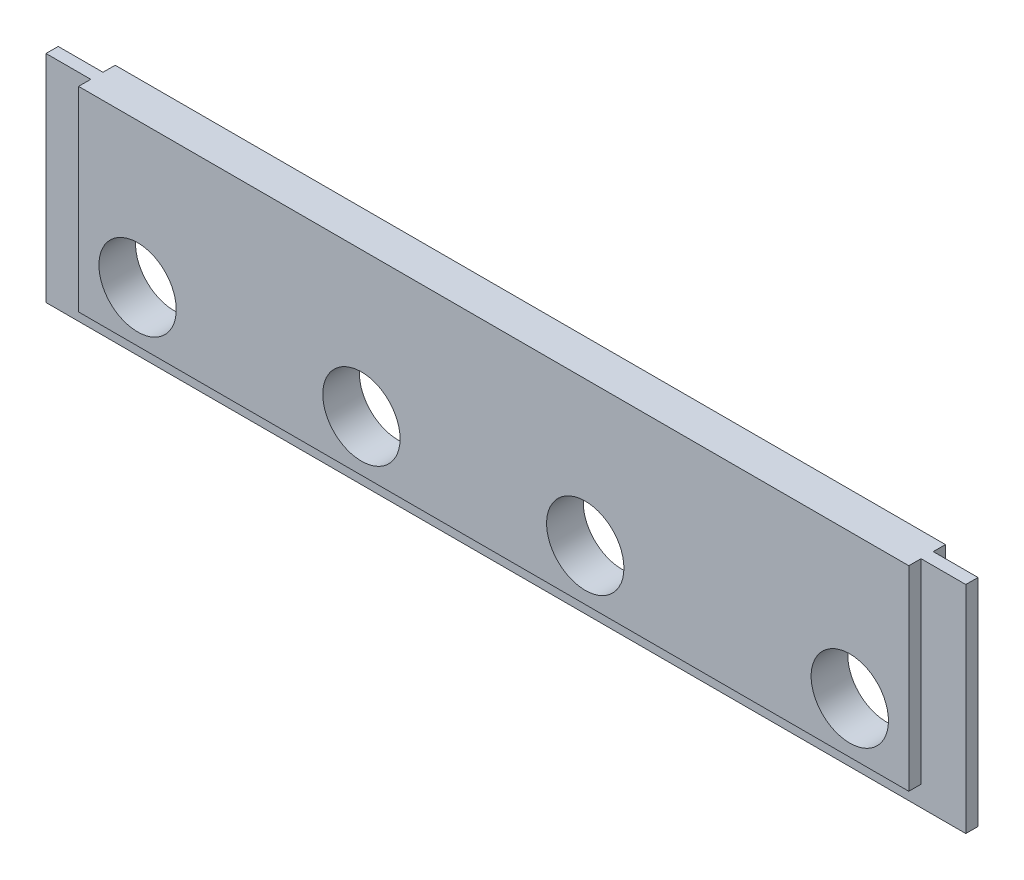
ISO-10303-21;
HEADER;
FILE_DESCRIPTION(('STEP AP214'),'2;1');
FILE_NAME('part.step','',(''),(''),'','','');
FILE_SCHEMA(('AUTOMOTIVE_DESIGN { 1 0 10303 214 1 1 1 1 }'));
ENDSEC;
DATA;
#1=APPLICATION_CONTEXT('core data for automotive mechanical design processes');
#2=APPLICATION_PROTOCOL_DEFINITION('international standard','automotive_design',2000,#1);
#3=PRODUCT_CONTEXT('',#1,'mechanical');
#4=PRODUCT('Part','Part','',(#3));
#5=PRODUCT_RELATED_PRODUCT_CATEGORY('part','',(#4));
#6=PRODUCT_DEFINITION_FORMATION('','',#4);
#7=PRODUCT_DEFINITION_CONTEXT('part definition',#1,'design');
#8=PRODUCT_DEFINITION('design','',#6,#7);
#9=PRODUCT_DEFINITION_SHAPE('','',#8);
#10=(LENGTH_UNIT() NAMED_UNIT(*) SI_UNIT(.MILLI.,.METRE.));
#11=(NAMED_UNIT(*) PLANE_ANGLE_UNIT() SI_UNIT($,.RADIAN.));
#12=(NAMED_UNIT(*) SI_UNIT($,.STERADIAN.) SOLID_ANGLE_UNIT());
#13=UNCERTAINTY_MEASURE_WITH_UNIT(LENGTH_MEASURE(1.E-05),#10,'distance_accuracy_value','');
#14=(GEOMETRIC_REPRESENTATION_CONTEXT(3) GLOBAL_UNCERTAINTY_ASSIGNED_CONTEXT((#13)) GLOBAL_UNIT_ASSIGNED_CONTEXT((#10,
#11,#12)) REPRESENTATION_CONTEXT('',''));
#15=CARTESIAN_POINT('',(0.,0.,0.));
#16=DIRECTION('',(0.,0.,1.));
#17=DIRECTION('',(1.,0.,0.));
#18=AXIS2_PLACEMENT_3D('',#15,#16,#17);
#19=CARTESIAN_POINT('',(-113.,-26.0197797000379,9.));
#20=DIRECTION('',(0.,1.,0.));
#21=DIRECTION('',(-1.,0.,0.));
#22=AXIS2_PLACEMENT_3D('',#19,#20,#21);
#23=PLANE('',#22);
#24=DIRECTION('',(1.,0.,0.));
#25=VECTOR('',#24,1.);
#26=CARTESIAN_POINT('',(0.,-26.0197797000379,3.));
#27=LINE('',#26,#25);
#28=CARTESIAN_POINT('',(-113.,-26.0197797000379,3.));
#29=VERTEX_POINT('',#28);
#30=CARTESIAN_POINT('',(113.,-26.0197797000379,3.00000000000002));
#31=VERTEX_POINT('',#30);
#32=EDGE_CURVE('E265',#29,#31,#27,.T.);
#33=ORIENTED_EDGE('',*,*,#32,.T.);
#34=DIRECTION('',(0.,0.,-1.));
#35=VECTOR('',#34,1.);
#36=CARTESIAN_POINT('',(113.,-26.0197797000379,9.));
#37=LINE('',#36,#35);
#38=CARTESIAN_POINT('',(113.,-26.0197797000379,6.00000000000002));
#39=VERTEX_POINT('',#38);
#40=EDGE_CURVE('E211',#39,#31,#37,.T.);
#41=ORIENTED_EDGE('',*,*,#40,.F.);
#42=DIRECTION('',(-1.,0.,0.));
#43=VECTOR('',#42,1.);
#44=CARTESIAN_POINT('',(0.,-26.0197797000379,6.));
#45=LINE('',#44,#43);
#46=CARTESIAN_POINT('',(-113.,-26.0197797000379,6.));
#47=VERTEX_POINT('',#46);
#48=EDGE_CURVE('E245',#39,#47,#45,.T.);
#49=ORIENTED_EDGE('',*,*,#48,.T.);
#50=DIRECTION('',(0.,0.,-1.));
#51=VECTOR('',#50,1.);
#52=CARTESIAN_POINT('',(-113.,-26.0197797000379,9.));
#53=LINE('',#52,#51);
#54=EDGE_CURVE('E218',#47,#29,#53,.T.);
#55=ORIENTED_EDGE('',*,*,#54,.T.);
#56=EDGE_LOOP('',(#33,#41,#49,#55));
#57=FACE_BOUND('',#56,.T.);
#58=ADVANCED_FACE('F40',(#57),#23,.F.);
#59=CARTESIAN_POINT('',(0.,0.,9.));
#60=DIRECTION('',(0.,0.,-1.));
#61=DIRECTION('',(-1.,0.,0.));
#62=AXIS2_PLACEMENT_3D('',#59,#60,#61);
#63=PLANE('',#62);
#64=CARTESIAN_POINT('',(-87.5,-8.51977970003793,9.));
#65=DIRECTION('',(0.,0.,1.));
#66=DIRECTION('',(1.,0.,0.));
#67=AXIS2_PLACEMENT_3D('',#64,#65,#66);
#68=CIRCLE('',#67,9.5);
#69=CARTESIAN_POINT('',(-78.,-8.51977970003793,9.));
#70=VERTEX_POINT('',#69);
#71=EDGE_CURVE('E181',#70,#70,#68,.T.);
#72=ORIENTED_EDGE('',*,*,#71,.F.);
#73=EDGE_LOOP('',(#72));
#74=FACE_BOUND('',#73,.T.);
#75=CARTESIAN_POINT('',(-32.5,-8.51977970003793,9.));
#76=DIRECTION('',(0.,0.,1.));
#77=DIRECTION('',(1.,0.,0.));
#78=AXIS2_PLACEMENT_3D('',#75,#76,#77);
#79=CIRCLE('',#78,9.5);
#80=CARTESIAN_POINT('',(-23.,-8.51977970003793,9.));
#81=VERTEX_POINT('',#80);
#82=EDGE_CURVE('E189',#81,#81,#79,.T.);
#83=ORIENTED_EDGE('',*,*,#82,.F.);
#84=EDGE_LOOP('',(#83));
#85=FACE_BOUND('',#84,.T.);
#86=CARTESIAN_POINT('',(22.5,-8.51977970003793,9.));
#87=DIRECTION('',(0.,0.,1.));
#88=DIRECTION('',(1.,0.,0.));
#89=AXIS2_PLACEMENT_3D('',#86,#87,#88);
#90=CIRCLE('',#89,9.5);
#91=CARTESIAN_POINT('',(32.,-8.51977970003793,9.));
#92=VERTEX_POINT('',#91);
#93=EDGE_CURVE('E197',#92,#92,#90,.T.);
#94=ORIENTED_EDGE('',*,*,#93,.F.);
#95=EDGE_LOOP('',(#94));
#96=FACE_BOUND('',#95,.T.);
#97=CARTESIAN_POINT('',(87.5,-8.51977970003793,9.));
#98=DIRECTION('',(0.,0.,1.));
#99=DIRECTION('',(1.,0.,0.));
#100=AXIS2_PLACEMENT_3D('',#97,#98,#99);
#101=CIRCLE('',#100,9.50000000000001);
#102=CARTESIAN_POINT('',(97.,-8.51977970003793,9.));
#103=VERTEX_POINT('',#102);
#104=EDGE_CURVE('E168',#103,#103,#101,.T.);
#105=ORIENTED_EDGE('',*,*,#104,.F.);
#106=EDGE_LOOP('',(#105));
#107=FACE_BOUND('',#106,.T.);
#108=DIRECTION('',(-1.,0.,0.));
#109=VECTOR('',#108,1.);
#110=CARTESIAN_POINT('',(113.,-21.0197797000379,9.));
#111=LINE('',#110,#109);
#112=CARTESIAN_POINT('',(102.,-21.0197797000379,9.));
#113=VERTEX_POINT('',#112);
#114=CARTESIAN_POINT('',(-102.,-21.0197797000379,9.));
#115=VERTEX_POINT('',#114);
#116=EDGE_CURVE('E131',#113,#115,#111,.T.);
#117=ORIENTED_EDGE('',*,*,#116,.F.);
#118=DIRECTION('',(0.,-1.,0.));
#119=VECTOR('',#118,1.);
#120=CARTESIAN_POINT('',(102.,26.9802202999621,9.));
#121=LINE('',#120,#119);
#122=CARTESIAN_POINT('',(102.,26.9802202999621,9.));
#123=VERTEX_POINT('',#122);
#124=EDGE_CURVE('E140',#123,#113,#121,.T.);
#125=ORIENTED_EDGE('',*,*,#124,.F.);
#126=DIRECTION('',(-1.,0.,0.));
#127=VECTOR('',#126,1.);
#128=CARTESIAN_POINT('',(-113.,26.9802202999621,9.));
#129=LINE('',#128,#127);
#130=CARTESIAN_POINT('',(-102.,26.9802202999621,9.));
#131=VERTEX_POINT('',#130);
#132=EDGE_CURVE('E208',#123,#131,#129,.T.);
#133=ORIENTED_EDGE('',*,*,#132,.T.);
#134=DIRECTION('',(0.,-1.,0.));
#135=VECTOR('',#134,1.);
#136=CARTESIAN_POINT('',(-102.,26.9802202999621,9.));
#137=LINE('',#136,#135);
#138=EDGE_CURVE('E142',#131,#115,#137,.T.);
#139=ORIENTED_EDGE('',*,*,#138,.T.);
#140=EDGE_LOOP('',(#117,#125,#133,#139));
#141=FACE_BOUND('',#140,.T.);
#142=ADVANCED_FACE('F138',(#74,#85,#96,#107,#141),#63,.F.);
#143=CARTESIAN_POINT('',(0.,0.,0.));
#144=DIRECTION('',(0.,0.,-1.));
#145=DIRECTION('',(-1.,0.,0.));
#146=AXIS2_PLACEMENT_3D('',#143,#144,#145);
#147=PLANE('',#146);
#148=CARTESIAN_POINT('',(-87.5,-8.51977970003793,0.));
#149=DIRECTION('',(0.,0.,1.));
#150=DIRECTION('',(1.,0.,0.));
#151=AXIS2_PLACEMENT_3D('',#148,#149,#150);
#152=CIRCLE('',#151,9.5);
#153=CARTESIAN_POINT('',(-78.,-8.51977970003793,0.));
#154=VERTEX_POINT('',#153);
#155=EDGE_CURVE('E176',#154,#154,#152,.T.);
#156=ORIENTED_EDGE('',*,*,#155,.T.);
#157=EDGE_LOOP('',(#156));
#158=FACE_BOUND('',#157,.T.);
#159=CARTESIAN_POINT('',(-32.5,-8.51977970003793,0.));
#160=DIRECTION('',(0.,0.,1.));
#161=DIRECTION('',(1.,0.,0.));
#162=AXIS2_PLACEMENT_3D('',#159,#160,#161);
#163=CIRCLE('',#162,9.5);
#164=CARTESIAN_POINT('',(-23.,-8.51977970003793,0.));
#165=VERTEX_POINT('',#164);
#166=EDGE_CURVE('E185',#165,#165,#163,.T.);
#167=ORIENTED_EDGE('',*,*,#166,.T.);
#168=EDGE_LOOP('',(#167));
#169=FACE_BOUND('',#168,.T.);
#170=CARTESIAN_POINT('',(22.5,-8.51977970003793,0.));
#171=DIRECTION('',(0.,0.,1.));
#172=DIRECTION('',(1.,0.,0.));
#173=AXIS2_PLACEMENT_3D('',#170,#171,#172);
#174=CIRCLE('',#173,9.5);
#175=CARTESIAN_POINT('',(32.,-8.51977970003793,0.));
#176=VERTEX_POINT('',#175);
#177=EDGE_CURVE('E193',#176,#176,#174,.T.);
#178=ORIENTED_EDGE('',*,*,#177,.T.);
#179=EDGE_LOOP('',(#178));
#180=FACE_BOUND('',#179,.T.);
#181=CARTESIAN_POINT('',(87.5,-8.51977970003793,0.));
#182=DIRECTION('',(0.,0.,1.));
#183=DIRECTION('',(1.,0.,0.));
#184=AXIS2_PLACEMENT_3D('',#181,#182,#183);
#185=CIRCLE('',#184,9.50000000000001);
#186=CARTESIAN_POINT('',(97.,-8.51977970003793,0.));
#187=VERTEX_POINT('',#186);
#188=EDGE_CURVE('E201',#187,#187,#185,.T.);
#189=ORIENTED_EDGE('',*,*,#188,.T.);
#190=EDGE_LOOP('',(#189));
#191=FACE_BOUND('',#190,.T.);
#192=DIRECTION('',(0.,-1.,0.));
#193=VECTOR('',#192,1.);
#194=CARTESIAN_POINT('',(102.,26.9802202999621,0.));
#195=LINE('',#194,#193);
#196=CARTESIAN_POINT('',(102.,26.9802202999621,0.));
#197=VERTEX_POINT('',#196);
#198=CARTESIAN_POINT('',(102.,-21.0197797000379,0.));
#199=VERTEX_POINT('',#198);
#200=EDGE_CURVE('E246',#197,#199,#195,.T.);
#201=ORIENTED_EDGE('',*,*,#200,.T.);
#202=DIRECTION('',(-1.,0.,0.));
#203=VECTOR('',#202,1.);
#204=CARTESIAN_POINT('',(113.,-21.0197797000379,0.));
#205=LINE('',#204,#203);
#206=CARTESIAN_POINT('',(-102.,-21.0197797000379,0.));
#207=VERTEX_POINT('',#206);
#208=EDGE_CURVE('E291',#199,#207,#205,.T.);
#209=ORIENTED_EDGE('',*,*,#208,.T.);
#210=DIRECTION('',(0.,-1.,0.));
#211=VECTOR('',#210,1.);
#212=CARTESIAN_POINT('',(-102.,26.9802202999621,0.));
#213=LINE('',#212,#211);
#214=CARTESIAN_POINT('',(-102.,26.9802202999621,0.));
#215=VERTEX_POINT('',#214);
#216=EDGE_CURVE('E274',#215,#207,#213,.T.);
#217=ORIENTED_EDGE('',*,*,#216,.F.);
#218=DIRECTION('',(-1.,0.,0.));
#219=VECTOR('',#218,1.);
#220=CARTESIAN_POINT('',(-113.,26.9802202999621,0.));
#221=LINE('',#220,#219);
#222=EDGE_CURVE('E180',#197,#215,#221,.T.);
#223=ORIENTED_EDGE('',*,*,#222,.F.);
#224=EDGE_LOOP('',(#201,#209,#217,#223));
#225=FACE_BOUND('',#224,.T.);
#226=ADVANCED_FACE('F312',(#158,#169,#180,#191,#225),#147,.T.);
#227=CARTESIAN_POINT('',(102.,26.9802202999621,1.57281595155231E-13));
#228=DIRECTION('',(-1.,0.,0.));
#229=DIRECTION('',(0.,0.,1.));
#230=AXIS2_PLACEMENT_3D('',#227,#228,#229);
#231=PLANE('',#230);
#232=DIRECTION('',(0.,0.,1.));
#233=VECTOR('',#232,1.);
#234=CARTESIAN_POINT('',(102.,-21.0197797000379,1.38777878078145E-13));
#235=LINE('',#234,#233);
#236=CARTESIAN_POINT('',(102.,-21.0197797000379,3.));
#237=VERTEX_POINT('',#236);
#238=EDGE_CURVE('E302',#199,#237,#235,.T.);
#239=ORIENTED_EDGE('',*,*,#238,.F.);
#240=ORIENTED_EDGE('',*,*,#200,.F.);
#241=DIRECTION('',(0.,0.,-1.));
#242=VECTOR('',#241,1.);
#243=CARTESIAN_POINT('',(102.,26.9802202999621,1.57281595155231E-13));
#244=LINE('',#243,#242);
#245=CARTESIAN_POINT('',(102.,26.9802202999621,3.00000000000002));
#246=VERTEX_POINT('',#245);
#247=EDGE_CURVE('E255',#246,#197,#244,.T.);
#248=ORIENTED_EDGE('',*,*,#247,.F.);
#249=DIRECTION('',(0.,-1.,0.));
#250=VECTOR('',#249,1.);
#251=CARTESIAN_POINT('',(102.,26.9802202999621,3.00000000000002));
#252=LINE('',#251,#250);
#253=EDGE_CURVE('E252',#246,#237,#252,.T.);
#254=ORIENTED_EDGE('',*,*,#253,.T.);
#255=EDGE_LOOP('',(#239,#240,#248,#254));
#256=FACE_BOUND('',#255,.T.);
#257=ADVANCED_FACE('F374',(#256),#231,.F.);
#258=CARTESIAN_POINT('',(-102.,26.9802202999621,1.57281595155231E-13));
#259=DIRECTION('',(-1.,0.,0.));
#260=DIRECTION('',(0.,0.,1.));
#261=AXIS2_PLACEMENT_3D('',#258,#259,#260);
#262=PLANE('',#261);
#263=ORIENTED_EDGE('',*,*,#216,.T.);
#264=DIRECTION('',(0.,0.,1.));
#265=VECTOR('',#264,1.);
#266=CARTESIAN_POINT('',(-102.,-21.0197797000379,1.38777878078145E-13));
#267=LINE('',#266,#265);
#268=CARTESIAN_POINT('',(-102.,-21.0197797000379,3.));
#269=VERTEX_POINT('',#268);
#270=EDGE_CURVE('E12',#207,#269,#267,.T.);
#271=ORIENTED_EDGE('',*,*,#270,.T.);
#272=DIRECTION('',(0.,-1.,0.));
#273=VECTOR('',#272,1.);
#274=CARTESIAN_POINT('',(-102.,26.9802202999621,3.));
#275=LINE('',#274,#273);
#276=CARTESIAN_POINT('',(-102.,26.9802202999621,3.));
#277=VERTEX_POINT('',#276);
#278=EDGE_CURVE('E162',#277,#269,#275,.T.);
#279=ORIENTED_EDGE('',*,*,#278,.F.);
#280=DIRECTION('',(0.,0.,-1.));
#281=VECTOR('',#280,1.);
#282=CARTESIAN_POINT('',(-102.,26.9802202999621,1.57281595155231E-13));
#283=LINE('',#282,#281);
#284=EDGE_CURVE('E264',#277,#215,#283,.T.);
#285=ORIENTED_EDGE('',*,*,#284,.T.);
#286=EDGE_LOOP('',(#263,#271,#279,#285));
#287=FACE_BOUND('',#286,.T.);
#288=ADVANCED_FACE('F314',(#287),#262,.T.);
#289=CARTESIAN_POINT('',(-102.,26.9802202999621,1.57281595155231E-13));
#290=DIRECTION('',(-1.,0.,0.));
#291=DIRECTION('',(0.,0.,1.));
#292=AXIS2_PLACEMENT_3D('',#289,#290,#291);
#293=PLANE('',#292);
#294=DIRECTION('',(0.,-1.,0.));
#295=VECTOR('',#294,1.);
#296=CARTESIAN_POINT('',(-102.,26.9802202999621,6.));
#297=LINE('',#296,#295);
#298=CARTESIAN_POINT('',(-102.,26.9802202999621,6.));
#299=VERTEX_POINT('',#298);
#300=CARTESIAN_POINT('',(-102.,-21.0197797000379,6.));
#301=VERTEX_POINT('',#300);
#302=EDGE_CURVE('E169',#299,#301,#297,.T.);
#303=ORIENTED_EDGE('',*,*,#302,.T.);
#304=DIRECTION('',(0.,0.,1.));
#305=VECTOR('',#304,1.);
#306=CARTESIAN_POINT('',(-102.,-21.0197797000379,1.38777878078145E-13));
#307=LINE('',#306,#305);
#308=EDGE_CURVE('E299',#301,#115,#307,.T.);
#309=ORIENTED_EDGE('',*,*,#308,.T.);
#310=ORIENTED_EDGE('',*,*,#138,.F.);
#311=DIRECTION('',(0.,0.,-1.));
#312=VECTOR('',#311,1.);
#313=CARTESIAN_POINT('',(-102.,26.9802202999621,1.57281595155231E-13));
#314=LINE('',#313,#312);
#315=EDGE_CURVE('E161',#131,#299,#314,.T.);
#316=ORIENTED_EDGE('',*,*,#315,.T.);
#317=EDGE_LOOP('',(#303,#309,#310,#316));
#318=FACE_BOUND('',#317,.T.);
#319=ADVANCED_FACE('F286',(#318),#293,.T.);
#320=CARTESIAN_POINT('',(102.,26.9802202999621,1.57281595155231E-13));
#321=DIRECTION('',(-1.,0.,0.));
#322=DIRECTION('',(0.,0.,1.));
#323=AXIS2_PLACEMENT_3D('',#320,#321,#322);
#324=PLANE('',#323);
#325=DIRECTION('',(0.,0.,1.));
#326=VECTOR('',#325,1.);
#327=CARTESIAN_POINT('',(102.,-21.0197797000379,1.38777878078145E-13));
#328=LINE('',#327,#326);
#329=CARTESIAN_POINT('',(102.,-21.0197797000379,6.00000000000002));
#330=VERTEX_POINT('',#329);
#331=EDGE_CURVE('E49',#330,#113,#328,.T.);
#332=ORIENTED_EDGE('',*,*,#331,.F.);
#333=DIRECTION('',(0.,-1.,0.));
#334=VECTOR('',#333,1.);
#335=CARTESIAN_POINT('',(102.,26.9802202999621,6.00000000000002));
#336=LINE('',#335,#334);
#337=CARTESIAN_POINT('',(102.,26.9802202999621,6.00000000000002));
#338=VERTEX_POINT('',#337);
#339=EDGE_CURVE('E147',#338,#330,#336,.T.);
#340=ORIENTED_EDGE('',*,*,#339,.F.);
#341=DIRECTION('',(0.,0.,-1.));
#342=VECTOR('',#341,1.);
#343=CARTESIAN_POINT('',(102.,26.9802202999621,1.57281595155231E-13));
#344=LINE('',#343,#342);
#345=EDGE_CURVE('E64',#123,#338,#344,.T.);
#346=ORIENTED_EDGE('',*,*,#345,.F.);
#347=ORIENTED_EDGE('',*,*,#124,.T.);
#348=EDGE_LOOP('',(#332,#340,#346,#347));
#349=FACE_BOUND('',#348,.T.);
#350=ADVANCED_FACE('F145',(#349),#324,.F.);
#351=CARTESIAN_POINT('',(113.,-26.0197797000379,9.));
#352=DIRECTION('',(-1.,0.,0.));
#353=DIRECTION('',(0.,0.,1.));
#354=AXIS2_PLACEMENT_3D('',#351,#352,#353);
#355=PLANE('',#354);
#356=DIRECTION('',(0.,-1.,0.));
#357=VECTOR('',#356,1.);
#358=CARTESIAN_POINT('',(113.,26.9802202999621,6.00000000000002));
#359=LINE('',#358,#357);
#360=CARTESIAN_POINT('',(113.,26.9802202999621,6.00000000000002));
#361=VERTEX_POINT('',#360);
#362=EDGE_CURVE('E152',#361,#39,#359,.T.);
#363=ORIENTED_EDGE('',*,*,#362,.T.);
#364=ORIENTED_EDGE('',*,*,#40,.T.);
#365=DIRECTION('',(0.,-1.,0.));
#366=VECTOR('',#365,1.);
#367=CARTESIAN_POINT('',(113.,26.9802202999621,3.00000000000002));
#368=LINE('',#367,#366);
#369=CARTESIAN_POINT('',(113.,26.9802202999621,3.00000000000002));
#370=VERTEX_POINT('',#369);
#371=EDGE_CURVE('E239',#370,#31,#368,.T.);
#372=ORIENTED_EDGE('',*,*,#371,.F.);
#373=DIRECTION('',(0.,0.,-1.));
#374=VECTOR('',#373,1.);
#375=CARTESIAN_POINT('',(113.,26.9802202999621,9.));
#376=LINE('',#375,#374);
#377=EDGE_CURVE('E135',#361,#370,#376,.T.);
#378=ORIENTED_EDGE('',*,*,#377,.F.);
#379=EDGE_LOOP('',(#363,#364,#372,#378));
#380=FACE_BOUND('',#379,.T.);
#381=ADVANCED_FACE('F42',(#380),#355,.F.);
#382=CARTESIAN_POINT('',(-113.,26.9802202999621,9.));
#383=DIRECTION('',(0.,-1.,0.));
#384=DIRECTION('',(1.,0.,0.));
#385=AXIS2_PLACEMENT_3D('',#382,#383,#384);
#386=PLANE('',#385);
#387=DIRECTION('',(1.,0.,0.));
#388=VECTOR('',#387,1.);
#389=CARTESIAN_POINT('',(0.,26.9802202999621,3.));
#390=LINE('',#389,#388);
#391=CARTESIAN_POINT('',(-113.,26.9802202999621,3.));
#392=VERTEX_POINT('',#391);
#393=EDGE_CURVE('E261',#392,#277,#390,.T.);
#394=ORIENTED_EDGE('',*,*,#393,.F.);
#395=DIRECTION('',(0.,0.,-1.));
#396=VECTOR('',#395,1.);
#397=CARTESIAN_POINT('',(-113.,26.9802202999621,9.));
#398=LINE('',#397,#396);
#399=CARTESIAN_POINT('',(-113.,26.9802202999621,6.));
#400=VERTEX_POINT('',#399);
#401=EDGE_CURVE('E222',#400,#392,#398,.T.);
#402=ORIENTED_EDGE('',*,*,#401,.F.);
#403=DIRECTION('',(1.,0.,0.));
#404=VECTOR('',#403,1.);
#405=CARTESIAN_POINT('',(0.,26.9802202999621,6.));
#406=LINE('',#405,#404);
#407=EDGE_CURVE('E157',#400,#299,#406,.T.);
#408=ORIENTED_EDGE('',*,*,#407,.T.);
#409=ORIENTED_EDGE('',*,*,#315,.F.);
#410=ORIENTED_EDGE('',*,*,#132,.F.);
#411=ORIENTED_EDGE('',*,*,#345,.T.);
#412=DIRECTION('',(-1.,0.,0.));
#413=VECTOR('',#412,1.);
#414=CARTESIAN_POINT('',(0.,26.9802202999621,6.));
#415=LINE('',#414,#413);
#416=EDGE_CURVE('E148',#361,#338,#415,.T.);
#417=ORIENTED_EDGE('',*,*,#416,.F.);
#418=ORIENTED_EDGE('',*,*,#377,.T.);
#419=DIRECTION('',(-1.,0.,0.));
#420=VECTOR('',#419,1.);
#421=CARTESIAN_POINT('',(0.,26.9802202999621,3.));
#422=LINE('',#421,#420);
#423=EDGE_CURVE('E235',#370,#246,#422,.T.);
#424=ORIENTED_EDGE('',*,*,#423,.T.);
#425=ORIENTED_EDGE('',*,*,#247,.T.);
#426=ORIENTED_EDGE('',*,*,#222,.T.);
#427=ORIENTED_EDGE('',*,*,#284,.F.);
#428=EDGE_LOOP('',(#394,#402,#408,#409,#410,#411,#417,#418,#424,#425,#426,#427));
#429=FACE_BOUND('',#428,.T.);
#430=ADVANCED_FACE('F233',(#429),#386,.F.);
#431=CARTESIAN_POINT('',(-113.,-26.0197797000379,9.));
#432=DIRECTION('',(1.,0.,0.));
#433=DIRECTION('',(0.,0.,-1.));
#434=AXIS2_PLACEMENT_3D('',#431,#432,#433);
#435=PLANE('',#434);
#436=DIRECTION('',(0.,-1.,0.));
#437=VECTOR('',#436,1.);
#438=CARTESIAN_POINT('',(-113.,26.9802202999621,3.));
#439=LINE('',#438,#437);
#440=EDGE_CURVE('E268',#392,#29,#439,.T.);
#441=ORIENTED_EDGE('',*,*,#440,.T.);
#442=ORIENTED_EDGE('',*,*,#54,.F.);
#443=DIRECTION('',(0.,-1.,0.));
#444=VECTOR('',#443,1.);
#445=CARTESIAN_POINT('',(-113.,26.9802202999621,6.));
#446=LINE('',#445,#444);
#447=EDGE_CURVE('E165',#400,#47,#446,.T.);
#448=ORIENTED_EDGE('',*,*,#447,.F.);
#449=ORIENTED_EDGE('',*,*,#401,.T.);
#450=EDGE_LOOP('',(#441,#442,#448,#449));
#451=FACE_BOUND('',#450,.T.);
#452=ADVANCED_FACE('F317',(#451),#435,.F.);
#453=CARTESIAN_POINT('',(87.5,-8.51977970003793,0.));
#454=DIRECTION('',(0.,0.,1.));
#455=DIRECTION('',(1.,0.,0.));
#456=AXIS2_PLACEMENT_3D('',#453,#454,#455);
#457=CYLINDRICAL_SURFACE('',#456,9.50000000000001);
#458=ORIENTED_EDGE('',*,*,#188,.F.);
#459=EDGE_LOOP('',(#458));
#460=FACE_BOUND('',#459,.T.);
#461=ORIENTED_EDGE('',*,*,#104,.T.);
#462=EDGE_LOOP('',(#461));
#463=FACE_BOUND('',#462,.T.);
#464=ADVANCED_FACE('F343',(#460,#463),#457,.F.);
#465=CARTESIAN_POINT('',(22.5,-8.51977970003793,0.));
#466=DIRECTION('',(0.,0.,1.));
#467=DIRECTION('',(1.,0.,0.));
#468=AXIS2_PLACEMENT_3D('',#465,#466,#467);
#469=CYLINDRICAL_SURFACE('',#468,9.5);
#470=ORIENTED_EDGE('',*,*,#177,.F.);
#471=EDGE_LOOP('',(#470));
#472=FACE_BOUND('',#471,.T.);
#473=ORIENTED_EDGE('',*,*,#93,.T.);
#474=EDGE_LOOP('',(#473));
#475=FACE_BOUND('',#474,.T.);
#476=ADVANCED_FACE('F359',(#472,#475),#469,.F.);
#477=CARTESIAN_POINT('',(-32.5,-8.51977970003793,0.));
#478=DIRECTION('',(0.,0.,1.));
#479=DIRECTION('',(1.,0.,0.));
#480=AXIS2_PLACEMENT_3D('',#477,#478,#479);
#481=CYLINDRICAL_SURFACE('',#480,9.5);
#482=ORIENTED_EDGE('',*,*,#166,.F.);
#483=EDGE_LOOP('',(#482));
#484=FACE_BOUND('',#483,.T.);
#485=ORIENTED_EDGE('',*,*,#82,.T.);
#486=EDGE_LOOP('',(#485));
#487=FACE_BOUND('',#486,.T.);
#488=ADVANCED_FACE('F329',(#484,#487),#481,.F.);
#489=CARTESIAN_POINT('',(-87.5,-8.51977970003793,0.));
#490=DIRECTION('',(0.,0.,1.));
#491=DIRECTION('',(1.,0.,0.));
#492=AXIS2_PLACEMENT_3D('',#489,#490,#491);
#493=CYLINDRICAL_SURFACE('',#492,9.5);
#494=ORIENTED_EDGE('',*,*,#155,.F.);
#495=EDGE_LOOP('',(#494));
#496=FACE_BOUND('',#495,.T.);
#497=ORIENTED_EDGE('',*,*,#71,.T.);
#498=EDGE_LOOP('',(#497));
#499=FACE_BOUND('',#498,.T.);
#500=ADVANCED_FACE('F322',(#496,#499),#493,.F.);
#501=CARTESIAN_POINT('',(0.,26.9802202999621,3.));
#502=DIRECTION('',(0.,0.,-1.));
#503=DIRECTION('',(-1.,0.,0.));
#504=AXIS2_PLACEMENT_3D('',#501,#502,#503);
#505=PLANE('',#504);
#506=ORIENTED_EDGE('',*,*,#32,.F.);
#507=ORIENTED_EDGE('',*,*,#440,.F.);
#508=ORIENTED_EDGE('',*,*,#393,.T.);
#509=ORIENTED_EDGE('',*,*,#278,.T.);
#510=DIRECTION('',(-1.,0.,0.));
#511=VECTOR('',#510,1.);
#512=CARTESIAN_POINT('',(113.,-21.0197797000379,3.));
#513=LINE('',#512,#511);
#514=EDGE_CURVE('E295',#237,#269,#513,.T.);
#515=ORIENTED_EDGE('',*,*,#514,.F.);
#516=ORIENTED_EDGE('',*,*,#253,.F.);
#517=ORIENTED_EDGE('',*,*,#423,.F.);
#518=ORIENTED_EDGE('',*,*,#371,.T.);
#519=EDGE_LOOP('',(#506,#507,#508,#509,#515,#516,#517,#518));
#520=FACE_BOUND('',#519,.T.);
#521=ADVANCED_FACE('F320',(#520),#505,.T.);
#522=CARTESIAN_POINT('',(0.,26.9802202999621,6.));
#523=DIRECTION('',(0.,0.,1.));
#524=DIRECTION('',(1.,0.,0.));
#525=AXIS2_PLACEMENT_3D('',#522,#523,#524);
#526=PLANE('',#525);
#527=ORIENTED_EDGE('',*,*,#48,.F.);
#528=ORIENTED_EDGE('',*,*,#362,.F.);
#529=ORIENTED_EDGE('',*,*,#416,.T.);
#530=ORIENTED_EDGE('',*,*,#339,.T.);
#531=DIRECTION('',(-1.,0.,0.));
#532=VECTOR('',#531,1.);
#533=CARTESIAN_POINT('',(113.,-21.0197797000379,6.));
#534=LINE('',#533,#532);
#535=EDGE_CURVE('E56',#330,#301,#534,.T.);
#536=ORIENTED_EDGE('',*,*,#535,.T.);
#537=ORIENTED_EDGE('',*,*,#302,.F.);
#538=ORIENTED_EDGE('',*,*,#407,.F.);
#539=ORIENTED_EDGE('',*,*,#447,.T.);
#540=EDGE_LOOP('',(#527,#528,#529,#530,#536,#537,#538,#539));
#541=FACE_BOUND('',#540,.T.);
#542=ADVANCED_FACE('F288',(#541),#526,.T.);
#543=CARTESIAN_POINT('',(113.,-21.0197797000379,0.));
#544=DIRECTION('',(0.,-1.,0.));
#545=DIRECTION('',(0.,0.,-1.));
#546=AXIS2_PLACEMENT_3D('',#543,#544,#545);
#547=PLANE('',#546);
#548=ORIENTED_EDGE('',*,*,#535,.F.);
#549=ORIENTED_EDGE('',*,*,#331,.T.);
#550=ORIENTED_EDGE('',*,*,#116,.T.);
#551=ORIENTED_EDGE('',*,*,#308,.F.);
#552=EDGE_LOOP('',(#548,#549,#550,#551));
#553=FACE_BOUND('',#552,.T.);
#554=ADVANCED_FACE('F130',(#553),#547,.T.);
#555=CARTESIAN_POINT('',(113.,-21.0197797000379,0.));
#556=DIRECTION('',(0.,-1.,0.));
#557=DIRECTION('',(0.,0.,-1.));
#558=AXIS2_PLACEMENT_3D('',#555,#556,#557);
#559=PLANE('',#558);
#560=ORIENTED_EDGE('',*,*,#238,.T.);
#561=ORIENTED_EDGE('',*,*,#514,.T.);
#562=ORIENTED_EDGE('',*,*,#270,.F.);
#563=ORIENTED_EDGE('',*,*,#208,.F.);
#564=EDGE_LOOP('',(#560,#561,#562,#563));
#565=FACE_BOUND('',#564,.T.);
#566=ADVANCED_FACE('F400',(#565),#559,.T.);
#567=CLOSED_SHELL('',(#58,#142,#226,#257,#288,#319,#350,#381,#430,#452,#464,#476,#488,#500,#521,
#542,#554,#566));
#568=MANIFOLD_SOLID_BREP('B2',#567);
#569=ADVANCED_BREP_SHAPE_REPRESENTATION('',(#18,#568),#14);
#570=SHAPE_DEFINITION_REPRESENTATION(#9,#569);
ENDSEC;
END-ISO-10303-21;
